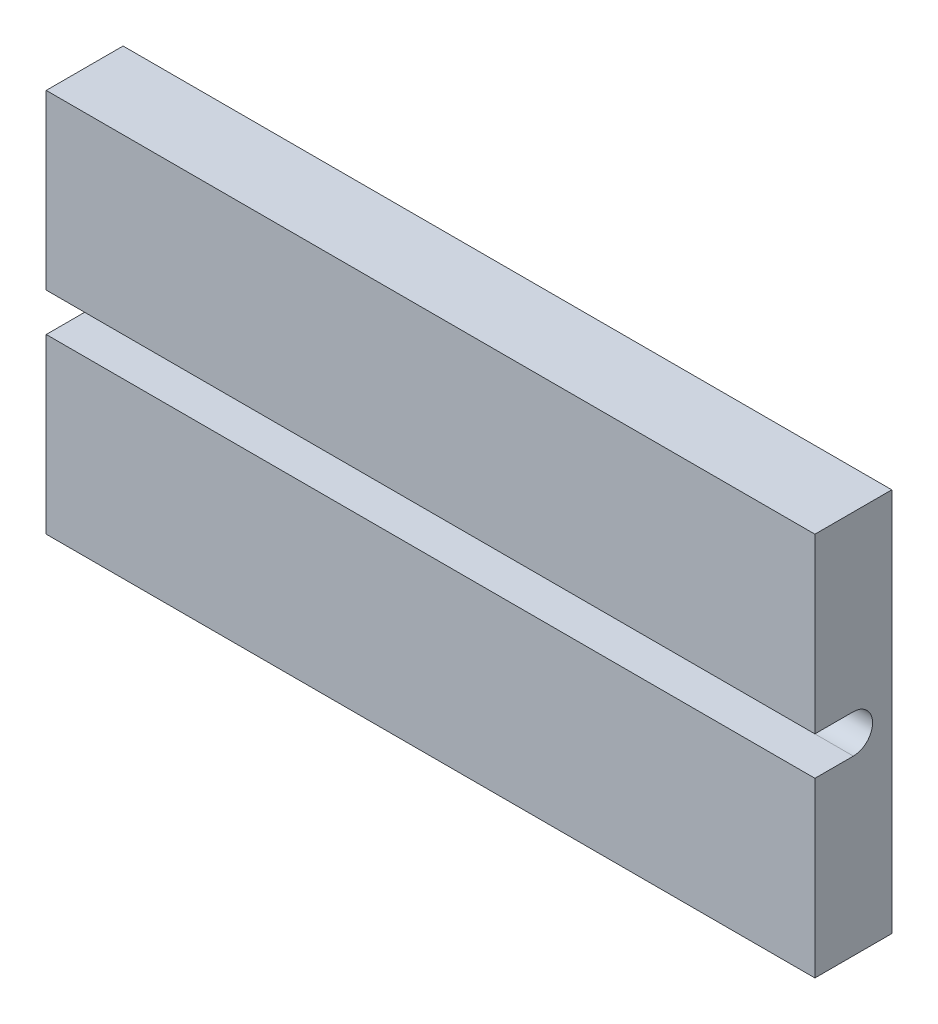
ISO-10303-21;
HEADER;
FILE_DESCRIPTION(('STEP AP214'),'2;1');
FILE_NAME('part.step','',(''),(''),'','','');
FILE_SCHEMA(('AUTOMOTIVE_DESIGN { 1 0 10303 214 1 1 1 1 }'));
ENDSEC;
DATA;
#1=APPLICATION_CONTEXT('core data for automotive mechanical design processes');
#2=APPLICATION_PROTOCOL_DEFINITION('international standard','automotive_design',2000,#1);
#3=PRODUCT_CONTEXT('',#1,'mechanical');
#4=PRODUCT('Part','Part','',(#3));
#5=PRODUCT_RELATED_PRODUCT_CATEGORY('part','',(#4));
#6=PRODUCT_DEFINITION_FORMATION('','',#4);
#7=PRODUCT_DEFINITION_CONTEXT('part definition',#1,'design');
#8=PRODUCT_DEFINITION('design','',#6,#7);
#9=PRODUCT_DEFINITION_SHAPE('','',#8);
#10=(LENGTH_UNIT() NAMED_UNIT(*) SI_UNIT(.MILLI.,.METRE.));
#11=(NAMED_UNIT(*) PLANE_ANGLE_UNIT() SI_UNIT($,.RADIAN.));
#12=(NAMED_UNIT(*) SI_UNIT($,.STERADIAN.) SOLID_ANGLE_UNIT());
#13=UNCERTAINTY_MEASURE_WITH_UNIT(LENGTH_MEASURE(1.E-05),#10,'distance_accuracy_value','');
#14=(GEOMETRIC_REPRESENTATION_CONTEXT(3) GLOBAL_UNCERTAINTY_ASSIGNED_CONTEXT((#13)) GLOBAL_UNIT_ASSIGNED_CONTEXT((#10,
#11,#12)) REPRESENTATION_CONTEXT('',''));
#15=CARTESIAN_POINT('',(0.,0.,0.));
#16=DIRECTION('',(0.,0.,1.));
#17=DIRECTION('',(1.,0.,0.));
#18=AXIS2_PLACEMENT_3D('',#15,#16,#17);
#19=CARTESIAN_POINT('',(0.,0.,20.));
#20=DIRECTION('',(0.,0.,-1.));
#21=DIRECTION('',(-1.,0.,0.));
#22=AXIS2_PLACEMENT_3D('',#19,#20,#21);
#23=PLANE('',#22);
#24=DIRECTION('',(0.,-1.,0.));
#25=VECTOR('',#24,1.);
#26=CARTESIAN_POINT('',(-100.,-50.,20.));
#27=LINE('',#26,#25);
#28=CARTESIAN_POINT('',(-100.,50.,20.));
#29=VERTEX_POINT('',#28);
#30=CARTESIAN_POINT('',(-100.,4.99999999999999,20.));
#31=VERTEX_POINT('',#30);
#32=EDGE_CURVE('E147',#29,#31,#27,.T.);
#33=ORIENTED_EDGE('',*,*,#32,.T.);
#34=DIRECTION('',(-1.,0.,0.));
#35=VECTOR('',#34,1.);
#36=CARTESIAN_POINT('',(100.,4.99999999999999,20.));
#37=LINE('',#36,#35);
#38=CARTESIAN_POINT('',(100.,4.99999999999999,20.));
#39=VERTEX_POINT('',#38);
#40=EDGE_CURVE('E139',#39,#31,#37,.T.);
#41=ORIENTED_EDGE('',*,*,#40,.F.);
#42=DIRECTION('',(0.,1.,0.));
#43=VECTOR('',#42,1.);
#44=CARTESIAN_POINT('',(100.,-50.,20.));
#45=LINE('',#44,#43);
#46=CARTESIAN_POINT('',(100.,50.,20.));
#47=VERTEX_POINT('',#46);
#48=EDGE_CURVE('E88',#39,#47,#45,.T.);
#49=ORIENTED_EDGE('',*,*,#48,.T.);
#50=DIRECTION('',(-1.,0.,0.));
#51=VECTOR('',#50,1.);
#52=CARTESIAN_POINT('',(-100.,50.,20.));
#53=LINE('',#52,#51);
#54=EDGE_CURVE('E144',#47,#29,#53,.T.);
#55=ORIENTED_EDGE('',*,*,#54,.T.);
#56=EDGE_LOOP('',(#33,#41,#49,#55));
#57=FACE_BOUND('',#56,.T.);
#58=ADVANCED_FACE('F35',(#57),#23,.F.);
#59=CARTESIAN_POINT('',(100.,-50.,20.));
#60=DIRECTION('',(-1.,0.,0.));
#61=DIRECTION('',(0.,0.,1.));
#62=AXIS2_PLACEMENT_3D('',#59,#60,#61);
#63=PLANE('',#62);
#64=ORIENTED_EDGE('',*,*,#48,.F.);
#65=DIRECTION('',(0.,0.,-1.));
#66=VECTOR('',#65,1.);
#67=CARTESIAN_POINT('',(100.,4.99999999999999,20.));
#68=LINE('',#67,#66);
#69=CARTESIAN_POINT('',(100.,4.99999999999999,10.));
#70=VERTEX_POINT('',#69);
#71=EDGE_CURVE('E120',#39,#70,#68,.T.);
#72=ORIENTED_EDGE('',*,*,#71,.T.);
#73=CARTESIAN_POINT('',(100.,0.,10.));
#74=DIRECTION('',(-1.,0.,0.));
#75=DIRECTION('',(0.,0.,1.));
#76=AXIS2_PLACEMENT_3D('',#73,#74,#75);
#77=CIRCLE('',#76,4.99999999999999);
#78=CARTESIAN_POINT('',(100.,-4.99999999999999,10.));
#79=VERTEX_POINT('',#78);
#80=EDGE_CURVE('E115',#70,#79,#77,.T.);
#81=ORIENTED_EDGE('',*,*,#80,.T.);
#82=DIRECTION('',(0.,0.,1.));
#83=VECTOR('',#82,1.);
#84=CARTESIAN_POINT('',(100.,-4.99999999999999,10.));
#85=LINE('',#84,#83);
#86=CARTESIAN_POINT('',(100.,-5.,20.));
#87=VERTEX_POINT('',#86);
#88=EDGE_CURVE('E123',#79,#87,#85,.T.);
#89=ORIENTED_EDGE('',*,*,#88,.T.);
#90=CARTESIAN_POINT('',(100.,-50.,20.));
#91=VERTEX_POINT('',#90);
#92=EDGE_CURVE('E142',#91,#87,#45,.T.);
#93=ORIENTED_EDGE('',*,*,#92,.F.);
#94=DIRECTION('',(0.,0.,-1.));
#95=VECTOR('',#94,1.);
#96=CARTESIAN_POINT('',(100.,-50.,20.));
#97=LINE('',#96,#95);
#98=CARTESIAN_POINT('',(100.,-50.,0.));
#99=VERTEX_POINT('',#98);
#100=EDGE_CURVE('E151',#91,#99,#97,.T.);
#101=ORIENTED_EDGE('',*,*,#100,.T.);
#102=DIRECTION('',(0.,1.,0.));
#103=VECTOR('',#102,1.);
#104=CARTESIAN_POINT('',(100.,-50.,0.));
#105=LINE('',#104,#103);
#106=CARTESIAN_POINT('',(100.,50.,0.));
#107=VERTEX_POINT('',#106);
#108=EDGE_CURVE('E138',#99,#107,#105,.T.);
#109=ORIENTED_EDGE('',*,*,#108,.T.);
#110=DIRECTION('',(0.,0.,-1.));
#111=VECTOR('',#110,1.);
#112=CARTESIAN_POINT('',(100.,50.,20.));
#113=LINE('',#112,#111);
#114=EDGE_CURVE('E11',#47,#107,#113,.T.);
#115=ORIENTED_EDGE('',*,*,#114,.F.);
#116=EDGE_LOOP('',(#64,#72,#81,#89,#93,#101,#109,#115));
#117=FACE_BOUND('',#116,.T.);
#118=ADVANCED_FACE('F37',(#117),#63,.F.);
#119=CARTESIAN_POINT('',(-100.,50.,20.));
#120=DIRECTION('',(0.,-1.,0.));
#121=DIRECTION('',(0.,0.,-1.));
#122=AXIS2_PLACEMENT_3D('',#119,#120,#121);
#123=PLANE('',#122);
#124=DIRECTION('',(-1.,0.,0.));
#125=VECTOR('',#124,1.);
#126=CARTESIAN_POINT('',(-100.,50.,0.));
#127=LINE('',#126,#125);
#128=CARTESIAN_POINT('',(-100.,50.,0.));
#129=VERTEX_POINT('',#128);
#130=EDGE_CURVE('E154',#107,#129,#127,.T.);
#131=ORIENTED_EDGE('',*,*,#130,.T.);
#132=DIRECTION('',(0.,0.,-1.));
#133=VECTOR('',#132,1.);
#134=CARTESIAN_POINT('',(-100.,50.,20.));
#135=LINE('',#134,#133);
#136=EDGE_CURVE('E43',#29,#129,#135,.T.);
#137=ORIENTED_EDGE('',*,*,#136,.F.);
#138=ORIENTED_EDGE('',*,*,#54,.F.);
#139=ORIENTED_EDGE('',*,*,#114,.T.);
#140=EDGE_LOOP('',(#131,#137,#138,#139));
#141=FACE_BOUND('',#140,.T.);
#142=ADVANCED_FACE('F190',(#141),#123,.F.);
#143=CARTESIAN_POINT('',(-100.,-50.,20.));
#144=DIRECTION('',(1.,0.,0.));
#145=DIRECTION('',(0.,0.,-1.));
#146=AXIS2_PLACEMENT_3D('',#143,#144,#145);
#147=PLANE('',#146);
#148=CARTESIAN_POINT('',(-100.,0.,10.));
#149=DIRECTION('',(-1.,0.,0.));
#150=DIRECTION('',(0.,0.,1.));
#151=AXIS2_PLACEMENT_3D('',#148,#149,#150);
#152=CIRCLE('',#151,4.99999999999999);
#153=CARTESIAN_POINT('',(-100.,4.99999999999999,10.));
#154=VERTEX_POINT('',#153);
#155=CARTESIAN_POINT('',(-100.,-4.99999999999999,10.));
#156=VERTEX_POINT('',#155);
#157=EDGE_CURVE('E118',#154,#156,#152,.T.);
#158=ORIENTED_EDGE('',*,*,#157,.F.);
#159=DIRECTION('',(0.,0.,-1.));
#160=VECTOR('',#159,1.);
#161=CARTESIAN_POINT('',(-100.,4.99999999999999,20.));
#162=LINE('',#161,#160);
#163=EDGE_CURVE('E128',#31,#154,#162,.T.);
#164=ORIENTED_EDGE('',*,*,#163,.F.);
#165=ORIENTED_EDGE('',*,*,#32,.F.);
#166=ORIENTED_EDGE('',*,*,#136,.T.);
#167=DIRECTION('',(0.,-1.,0.));
#168=VECTOR('',#167,1.);
#169=CARTESIAN_POINT('',(-100.,-50.,0.));
#170=LINE('',#169,#168);
#171=CARTESIAN_POINT('',(-100.,-50.,0.));
#172=VERTEX_POINT('',#171);
#173=EDGE_CURVE('E156',#129,#172,#170,.T.);
#174=ORIENTED_EDGE('',*,*,#173,.T.);
#175=DIRECTION('',(0.,0.,-1.));
#176=VECTOR('',#175,1.);
#177=CARTESIAN_POINT('',(-100.,-50.,20.));
#178=LINE('',#177,#176);
#179=CARTESIAN_POINT('',(-100.,-50.,20.));
#180=VERTEX_POINT('',#179);
#181=EDGE_CURVE('E160',#180,#172,#178,.T.);
#182=ORIENTED_EDGE('',*,*,#181,.F.);
#183=CARTESIAN_POINT('',(-100.,-5.,20.));
#184=VERTEX_POINT('',#183);
#185=EDGE_CURVE('E146',#184,#180,#27,.T.);
#186=ORIENTED_EDGE('',*,*,#185,.F.);
#187=DIRECTION('',(0.,0.,1.));
#188=VECTOR('',#187,1.);
#189=CARTESIAN_POINT('',(-100.,-4.99999999999999,10.));
#190=LINE('',#189,#188);
#191=EDGE_CURVE('E50',#156,#184,#190,.T.);
#192=ORIENTED_EDGE('',*,*,#191,.F.);
#193=EDGE_LOOP('',(#158,#164,#165,#166,#174,#182,#186,#192));
#194=FACE_BOUND('',#193,.T.);
#195=ADVANCED_FACE('F166',(#194),#147,.F.);
#196=CARTESIAN_POINT('',(-100.,-50.,20.));
#197=DIRECTION('',(0.,1.,0.));
#198=DIRECTION('',(0.,0.,1.));
#199=AXIS2_PLACEMENT_3D('',#196,#197,#198);
#200=PLANE('',#199);
#201=DIRECTION('',(1.,0.,0.));
#202=VECTOR('',#201,1.);
#203=CARTESIAN_POINT('',(-100.,-50.,0.));
#204=LINE('',#203,#202);
#205=EDGE_CURVE('E80',#172,#99,#204,.T.);
#206=ORIENTED_EDGE('',*,*,#205,.T.);
#207=ORIENTED_EDGE('',*,*,#100,.F.);
#208=DIRECTION('',(1.,0.,0.));
#209=VECTOR('',#208,1.);
#210=CARTESIAN_POINT('',(-100.,-50.,20.));
#211=LINE('',#210,#209);
#212=EDGE_CURVE('E59',#180,#91,#211,.T.);
#213=ORIENTED_EDGE('',*,*,#212,.F.);
#214=ORIENTED_EDGE('',*,*,#181,.T.);
#215=EDGE_LOOP('',(#206,#207,#213,#214));
#216=FACE_BOUND('',#215,.T.);
#217=ADVANCED_FACE('F174',(#216),#200,.F.);
#218=ORIENTED_EDGE('',*,*,#92,.T.);
#219=DIRECTION('',(-1.,0.,0.));
#220=VECTOR('',#219,1.);
#221=CARTESIAN_POINT('',(100.,-5.,20.));
#222=LINE('',#221,#220);
#223=EDGE_CURVE('E119',#87,#184,#222,.T.);
#224=ORIENTED_EDGE('',*,*,#223,.T.);
#225=ORIENTED_EDGE('',*,*,#185,.T.);
#226=ORIENTED_EDGE('',*,*,#212,.T.);
#227=EDGE_LOOP('',(#218,#224,#225,#226));
#228=FACE_BOUND('',#227,.T.);
#229=ADVANCED_FACE('F176',(#228),#23,.F.);
#230=CARTESIAN_POINT('',(0.,0.,0.));
#231=DIRECTION('',(0.,0.,-1.));
#232=DIRECTION('',(-1.,0.,0.));
#233=AXIS2_PLACEMENT_3D('',#230,#231,#232);
#234=PLANE('',#233);
#235=ORIENTED_EDGE('',*,*,#108,.F.);
#236=ORIENTED_EDGE('',*,*,#205,.F.);
#237=ORIENTED_EDGE('',*,*,#173,.F.);
#238=ORIENTED_EDGE('',*,*,#130,.F.);
#239=EDGE_LOOP('',(#235,#236,#237,#238));
#240=FACE_BOUND('',#239,.T.);
#241=ADVANCED_FACE('F172',(#240),#234,.T.);
#242=CARTESIAN_POINT('',(100.,0.,10.));
#243=DIRECTION('',(-1.,0.,0.));
#244=DIRECTION('',(0.,0.,1.));
#245=AXIS2_PLACEMENT_3D('',#242,#243,#244);
#246=CYLINDRICAL_SURFACE('',#245,4.99999999999999);
#247=ORIENTED_EDGE('',*,*,#157,.T.);
#248=DIRECTION('',(-1.,0.,0.));
#249=VECTOR('',#248,1.);
#250=CARTESIAN_POINT('',(100.,-4.99999999999999,10.));
#251=LINE('',#250,#249);
#252=EDGE_CURVE('E111',#79,#156,#251,.T.);
#253=ORIENTED_EDGE('',*,*,#252,.F.);
#254=ORIENTED_EDGE('',*,*,#80,.F.);
#255=DIRECTION('',(-1.,0.,0.));
#256=VECTOR('',#255,1.);
#257=CARTESIAN_POINT('',(100.,4.99999999999999,10.));
#258=LINE('',#257,#256);
#259=EDGE_CURVE('E136',#70,#154,#258,.T.);
#260=ORIENTED_EDGE('',*,*,#259,.T.);
#261=EDGE_LOOP('',(#247,#253,#254,#260));
#262=FACE_BOUND('',#261,.T.);
#263=ADVANCED_FACE('F113',(#262),#246,.F.);
#264=CARTESIAN_POINT('',(100.,4.99999999999999,20.));
#265=DIRECTION('',(0.,1.,0.));
#266=DIRECTION('',(0.,0.,1.));
#267=AXIS2_PLACEMENT_3D('',#264,#265,#266);
#268=PLANE('',#267);
#269=ORIENTED_EDGE('',*,*,#163,.T.);
#270=ORIENTED_EDGE('',*,*,#259,.F.);
#271=ORIENTED_EDGE('',*,*,#71,.F.);
#272=ORIENTED_EDGE('',*,*,#40,.T.);
#273=EDGE_LOOP('',(#269,#270,#271,#272));
#274=FACE_BOUND('',#273,.T.);
#275=ADVANCED_FACE('F235',(#274),#268,.F.);
#276=CARTESIAN_POINT('',(100.,-4.99999999999999,10.));
#277=DIRECTION('',(0.,-1.,0.));
#278=DIRECTION('',(0.,0.,-1.));
#279=AXIS2_PLACEMENT_3D('',#276,#277,#278);
#280=PLANE('',#279);
#281=ORIENTED_EDGE('',*,*,#191,.T.);
#282=ORIENTED_EDGE('',*,*,#223,.F.);
#283=ORIENTED_EDGE('',*,*,#88,.F.);
#284=ORIENTED_EDGE('',*,*,#252,.T.);
#285=EDGE_LOOP('',(#281,#282,#283,#284));
#286=FACE_BOUND('',#285,.T.);
#287=ADVANCED_FACE('F124',(#286),#280,.F.);
#288=CLOSED_SHELL('',(#58,#118,#142,#195,#217,#229,#241,#263,#275,#287));
#289=MANIFOLD_SOLID_BREP('B2',#288);
#290=ADVANCED_BREP_SHAPE_REPRESENTATION('',(#18,#289),#14);
#291=SHAPE_DEFINITION_REPRESENTATION(#9,#290);
ENDSEC;
END-ISO-10303-21;
